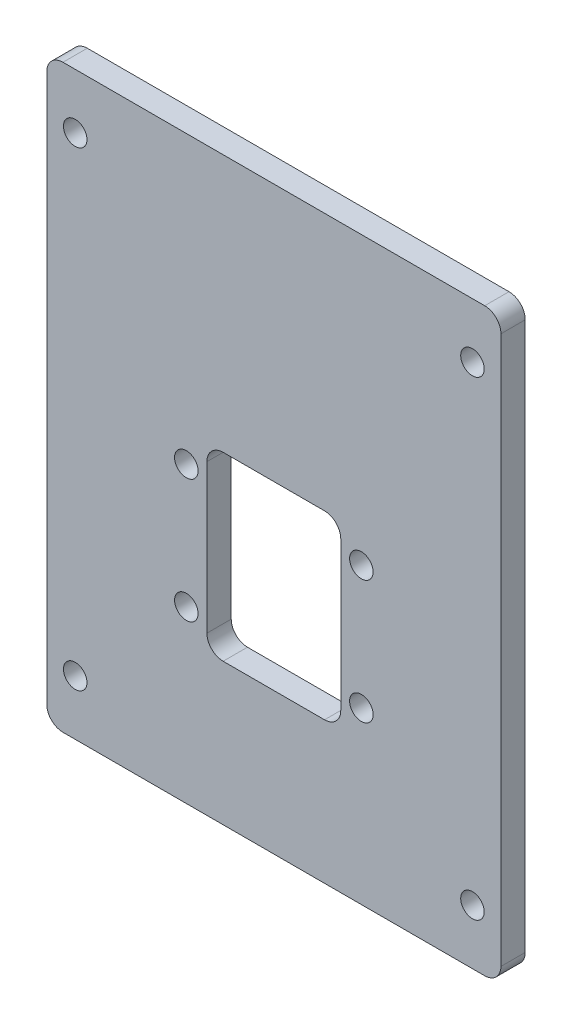
ISO-10303-21;
HEADER;
FILE_DESCRIPTION(('STEP AP214'),'2;1');
FILE_NAME('part.step','',(''),(''),'','','');
FILE_SCHEMA(('AUTOMOTIVE_DESIGN { 1 0 10303 214 1 1 1 1 }'));
ENDSEC;
DATA;
#1=APPLICATION_CONTEXT('core data for automotive mechanical design processes');
#2=APPLICATION_PROTOCOL_DEFINITION('international standard','automotive_design',2000,#1);
#3=PRODUCT_CONTEXT('',#1,'mechanical');
#4=PRODUCT('Part','Part','',(#3));
#5=PRODUCT_RELATED_PRODUCT_CATEGORY('part','',(#4));
#6=PRODUCT_DEFINITION_FORMATION('','',#4);
#7=PRODUCT_DEFINITION_CONTEXT('part definition',#1,'design');
#8=PRODUCT_DEFINITION('design','',#6,#7);
#9=PRODUCT_DEFINITION_SHAPE('','',#8);
#10=(LENGTH_UNIT() NAMED_UNIT(*) SI_UNIT(.MILLI.,.METRE.));
#11=(NAMED_UNIT(*) PLANE_ANGLE_UNIT() SI_UNIT($,.RADIAN.));
#12=(NAMED_UNIT(*) SI_UNIT($,.STERADIAN.) SOLID_ANGLE_UNIT());
#13=UNCERTAINTY_MEASURE_WITH_UNIT(LENGTH_MEASURE(1.E-05),#10,'distance_accuracy_value','');
#14=(GEOMETRIC_REPRESENTATION_CONTEXT(3) GLOBAL_UNCERTAINTY_ASSIGNED_CONTEXT((#13)) GLOBAL_UNIT_ASSIGNED_CONTEXT((#10,
#11,#12)) REPRESENTATION_CONTEXT('',''));
#15=CARTESIAN_POINT('',(0.,0.,0.));
#16=DIRECTION('',(0.,0.,1.));
#17=DIRECTION('',(1.,0.,0.));
#18=AXIS2_PLACEMENT_3D('',#15,#16,#17);
#19=CARTESIAN_POINT('',(0.,0.,3.));
#20=DIRECTION('',(0.,0.,1.));
#21=DIRECTION('',(1.,0.,0.));
#22=AXIS2_PLACEMENT_3D('',#19,#20,#21);
#23=PLANE('',#22);
#24=CARTESIAN_POINT('',(-24.5,-21.84,3.));
#25=DIRECTION('',(0.,0.,1.));
#26=DIRECTION('',(1.,0.,0.));
#27=AXIS2_PLACEMENT_3D('',#24,#25,#26);
#28=CIRCLE('',#27,1.45);
#29=CARTESIAN_POINT('',(-23.05,-21.84,3.));
#30=VERTEX_POINT('',#29);
#31=EDGE_CURVE('E589',#30,#30,#28,.T.);
#32=ORIENTED_EDGE('',*,*,#31,.F.);
#33=EDGE_LOOP('',(#32));
#34=FACE_BOUND('',#33,.T.);
#35=CARTESIAN_POINT('',(24.5,-21.84,3.));
#36=DIRECTION('',(0.,0.,1.));
#37=DIRECTION('',(1.,0.,0.));
#38=AXIS2_PLACEMENT_3D('',#35,#36,#37);
#39=CIRCLE('',#38,1.45);
#40=CARTESIAN_POINT('',(25.95,-21.84,3.));
#41=VERTEX_POINT('',#40);
#42=EDGE_CURVE('E577',#41,#41,#39,.T.);
#43=ORIENTED_EDGE('',*,*,#42,.F.);
#44=EDGE_LOOP('',(#43));
#45=FACE_BOUND('',#44,.T.);
#46=CARTESIAN_POINT('',(10.795,7.62,3.));
#47=DIRECTION('',(0.,0.,1.));
#48=DIRECTION('',(1.,0.,0.));
#49=AXIS2_PLACEMENT_3D('',#46,#47,#48);
#50=CIRCLE('',#49,1.45);
#51=CARTESIAN_POINT('',(12.245,7.62,3.));
#52=VERTEX_POINT('',#51);
#53=EDGE_CURVE('E565',#52,#52,#50,.T.);
#54=ORIENTED_EDGE('',*,*,#53,.F.);
#55=EDGE_LOOP('',(#54));
#56=FACE_BOUND('',#55,.T.);
#57=CARTESIAN_POINT('',(-10.795,-7.62,3.));
#58=DIRECTION('',(0.,0.,1.));
#59=DIRECTION('',(1.,0.,0.));
#60=AXIS2_PLACEMENT_3D('',#57,#58,#59);
#61=CIRCLE('',#60,1.45);
#62=CARTESIAN_POINT('',(-9.34499999999999,-7.62,3.));
#63=VERTEX_POINT('',#62);
#64=EDGE_CURVE('E264',#63,#63,#61,.T.);
#65=ORIENTED_EDGE('',*,*,#64,.F.);
#66=EDGE_LOOP('',(#65));
#67=FACE_BOUND('',#66,.T.);
#68=DIRECTION('',(-1.,0.,0.));
#69=VECTOR('',#68,1.);
#70=CARTESIAN_POINT('',(-28.01,42.95,3.));
#71=LINE('',#70,#69);
#72=CARTESIAN_POINT('',(26.01,42.95,3.));
#73=VERTEX_POINT('',#72);
#74=CARTESIAN_POINT('',(-26.01,42.95,3.));
#75=VERTEX_POINT('',#74);
#76=EDGE_CURVE('E172',#73,#75,#71,.T.);
#77=ORIENTED_EDGE('',*,*,#76,.T.);
#78=CARTESIAN_POINT('',(-26.01,40.95,3.));
#79=DIRECTION('',(0.,0.,1.));
#80=DIRECTION('',(1.,0.,0.));
#81=AXIS2_PLACEMENT_3D('',#78,#79,#80);
#82=CIRCLE('',#81,2.);
#83=CARTESIAN_POINT('',(-28.01,40.95,3.));
#84=VERTEX_POINT('',#83);
#85=EDGE_CURVE('E219',#75,#84,#82,.T.);
#86=ORIENTED_EDGE('',*,*,#85,.T.);
#87=DIRECTION('',(0.,-1.,0.));
#88=VECTOR('',#87,1.);
#89=CARTESIAN_POINT('',(-28.01,42.95,3.));
#90=LINE('',#89,#88);
#91=CARTESIAN_POINT('',(-28.01,-26.63,3.));
#92=VERTEX_POINT('',#91);
#93=EDGE_CURVE('E274',#84,#92,#90,.T.);
#94=ORIENTED_EDGE('',*,*,#93,.T.);
#95=CARTESIAN_POINT('',(-26.01,-26.63,3.));
#96=DIRECTION('',(0.,0.,1.));
#97=DIRECTION('',(1.,0.,0.));
#98=AXIS2_PLACEMENT_3D('',#95,#96,#97);
#99=CIRCLE('',#98,2.);
#100=CARTESIAN_POINT('',(-26.01,-28.63,3.));
#101=VERTEX_POINT('',#100);
#102=EDGE_CURVE('E215',#92,#101,#99,.T.);
#103=ORIENTED_EDGE('',*,*,#102,.T.);
#104=DIRECTION('',(1.,0.,0.));
#105=VECTOR('',#104,1.);
#106=CARTESIAN_POINT('',(-28.01,-28.63,3.));
#107=LINE('',#106,#105);
#108=CARTESIAN_POINT('',(26.01,-28.63,3.));
#109=VERTEX_POINT('',#108);
#110=EDGE_CURVE('E277',#101,#109,#107,.T.);
#111=ORIENTED_EDGE('',*,*,#110,.T.);
#112=CARTESIAN_POINT('',(26.01,-26.63,3.));
#113=DIRECTION('',(0.,0.,1.));
#114=DIRECTION('',(1.,0.,0.));
#115=AXIS2_PLACEMENT_3D('',#112,#113,#114);
#116=CIRCLE('',#115,2.);
#117=CARTESIAN_POINT('',(28.01,-26.63,3.));
#118=VERTEX_POINT('',#117);
#119=EDGE_CURVE('E56',#109,#118,#116,.T.);
#120=ORIENTED_EDGE('',*,*,#119,.T.);
#121=DIRECTION('',(0.,1.,0.));
#122=VECTOR('',#121,1.);
#123=CARTESIAN_POINT('',(28.01,42.95,3.));
#124=LINE('',#123,#122);
#125=CARTESIAN_POINT('',(28.01,40.95,3.));
#126=VERTEX_POINT('',#125);
#127=EDGE_CURVE('E177',#118,#126,#124,.T.);
#128=ORIENTED_EDGE('',*,*,#127,.T.);
#129=CARTESIAN_POINT('',(26.01,40.95,3.));
#130=DIRECTION('',(0.,0.,1.));
#131=DIRECTION('',(1.,0.,0.));
#132=AXIS2_PLACEMENT_3D('',#129,#130,#131);
#133=CIRCLE('',#132,2.);
#134=EDGE_CURVE('E217',#126,#73,#133,.T.);
#135=ORIENTED_EDGE('',*,*,#134,.T.);
#136=EDGE_LOOP('',(#77,#86,#94,#103,#111,#120,#128,#135));
#137=FACE_BOUND('',#136,.T.);
#138=DIRECTION('',(1.,0.,0.));
#139=VECTOR('',#138,1.);
#140=CARTESIAN_POINT('',(-8.25499999999999,-11.16,3.));
#141=LINE('',#140,#139);
#142=CARTESIAN_POINT('',(-6.25499999999999,-11.16,3.));
#143=VERTEX_POINT('',#142);
#144=CARTESIAN_POINT('',(6.25500000000001,-11.16,3.));
#145=VERTEX_POINT('',#144);
#146=EDGE_CURVE('E555',#143,#145,#141,.T.);
#147=ORIENTED_EDGE('',*,*,#146,.F.);
#148=CARTESIAN_POINT('',(-6.25499999999999,-9.16,3.));
#149=DIRECTION('',(0.,0.,1.));
#150=DIRECTION('',(1.,0.,0.));
#151=AXIS2_PLACEMENT_3D('',#148,#149,#150);
#152=CIRCLE('',#151,2.);
#153=CARTESIAN_POINT('',(-8.25499999999999,-9.16,3.));
#154=VERTEX_POINT('',#153);
#155=EDGE_CURVE('E11',#143,#154,#152,.F.);
#156=ORIENTED_EDGE('',*,*,#155,.T.);
#157=DIRECTION('',(0.,-1.,0.));
#158=VECTOR('',#157,1.);
#159=CARTESIAN_POINT('',(-8.25499999999999,11.16,3.));
#160=LINE('',#159,#158);
#161=CARTESIAN_POINT('',(-8.25499999999999,9.16,3.));
#162=VERTEX_POINT('',#161);
#163=EDGE_CURVE('E249',#162,#154,#160,.T.);
#164=ORIENTED_EDGE('',*,*,#163,.F.);
#165=CARTESIAN_POINT('',(-6.25499999999999,9.16,3.));
#166=DIRECTION('',(0.,0.,1.));
#167=DIRECTION('',(1.,0.,0.));
#168=AXIS2_PLACEMENT_3D('',#165,#166,#167);
#169=CIRCLE('',#168,2.);
#170=CARTESIAN_POINT('',(-6.25499999999999,11.16,3.));
#171=VERTEX_POINT('',#170);
#172=EDGE_CURVE('E159',#162,#171,#169,.F.);
#173=ORIENTED_EDGE('',*,*,#172,.T.);
#174=DIRECTION('',(-1.,0.,0.));
#175=VECTOR('',#174,1.);
#176=CARTESIAN_POINT('',(-8.25499999999999,11.16,3.));
#177=LINE('',#176,#175);
#178=CARTESIAN_POINT('',(6.25500000000001,11.16,3.));
#179=VERTEX_POINT('',#178);
#180=EDGE_CURVE('E246',#179,#171,#177,.T.);
#181=ORIENTED_EDGE('',*,*,#180,.F.);
#182=CARTESIAN_POINT('',(6.25500000000001,9.16,3.));
#183=DIRECTION('',(0.,0.,1.));
#184=DIRECTION('',(1.,0.,0.));
#185=AXIS2_PLACEMENT_3D('',#182,#183,#184);
#186=CIRCLE('',#185,2.);
#187=CARTESIAN_POINT('',(8.25500000000001,9.16,3.));
#188=VERTEX_POINT('',#187);
#189=EDGE_CURVE('E236',#179,#188,#186,.F.);
#190=ORIENTED_EDGE('',*,*,#189,.T.);
#191=DIRECTION('',(0.,1.,0.));
#192=VECTOR('',#191,1.);
#193=CARTESIAN_POINT('',(8.25500000000001,11.16,3.));
#194=LINE('',#193,#192);
#195=CARTESIAN_POINT('',(8.25500000000001,-9.16,3.));
#196=VERTEX_POINT('',#195);
#197=EDGE_CURVE('E258',#196,#188,#194,.T.);
#198=ORIENTED_EDGE('',*,*,#197,.F.);
#199=CARTESIAN_POINT('',(6.25500000000001,-9.16,3.));
#200=DIRECTION('',(0.,0.,1.));
#201=DIRECTION('',(1.,0.,0.));
#202=AXIS2_PLACEMENT_3D('',#199,#200,#201);
#203=CIRCLE('',#202,2.);
#204=EDGE_CURVE('E232',#196,#145,#203,.F.);
#205=ORIENTED_EDGE('',*,*,#204,.T.);
#206=EDGE_LOOP('',(#147,#156,#164,#173,#181,#190,#198,#205));
#207=FACE_BOUND('',#206,.T.);
#208=CARTESIAN_POINT('',(-10.795,7.62,3.));
#209=DIRECTION('',(0.,0.,1.));
#210=DIRECTION('',(1.,0.,0.));
#211=AXIS2_PLACEMENT_3D('',#208,#209,#210);
#212=CIRCLE('',#211,1.45);
#213=CARTESIAN_POINT('',(-9.34499999999999,7.62,3.));
#214=VERTEX_POINT('',#213);
#215=EDGE_CURVE('E560',#214,#214,#212,.T.);
#216=ORIENTED_EDGE('',*,*,#215,.F.);
#217=EDGE_LOOP('',(#216));
#218=FACE_BOUND('',#217,.T.);
#219=CARTESIAN_POINT('',(10.795,-7.62,3.));
#220=DIRECTION('',(0.,0.,1.));
#221=DIRECTION('',(1.,0.,0.));
#222=AXIS2_PLACEMENT_3D('',#219,#220,#221);
#223=CIRCLE('',#222,1.45);
#224=CARTESIAN_POINT('',(12.245,-7.62,3.));
#225=VERTEX_POINT('',#224);
#226=EDGE_CURVE('E571',#225,#225,#223,.T.);
#227=ORIENTED_EDGE('',*,*,#226,.F.);
#228=EDGE_LOOP('',(#227));
#229=FACE_BOUND('',#228,.T.);
#230=CARTESIAN_POINT('',(-24.5,36.16,3.));
#231=DIRECTION('',(0.,0.,1.));
#232=DIRECTION('',(1.,0.,0.));
#233=AXIS2_PLACEMENT_3D('',#230,#231,#232);
#234=CIRCLE('',#233,1.45);
#235=CARTESIAN_POINT('',(-23.05,36.16,3.));
#236=VERTEX_POINT('',#235);
#237=EDGE_CURVE('E583',#236,#236,#234,.T.);
#238=ORIENTED_EDGE('',*,*,#237,.F.);
#239=EDGE_LOOP('',(#238));
#240=FACE_BOUND('',#239,.T.);
#241=CARTESIAN_POINT('',(24.5,36.16,3.));
#242=DIRECTION('',(0.,0.,1.));
#243=DIRECTION('',(1.,0.,0.));
#244=AXIS2_PLACEMENT_3D('',#241,#242,#243);
#245=CIRCLE('',#244,1.45);
#246=CARTESIAN_POINT('',(25.95,36.16,3.));
#247=VERTEX_POINT('',#246);
#248=EDGE_CURVE('E595',#247,#247,#245,.T.);
#249=ORIENTED_EDGE('',*,*,#248,.F.);
#250=EDGE_LOOP('',(#249));
#251=FACE_BOUND('',#250,.T.);
#252=ADVANCED_FACE('F34',(#34,#45,#56,#67,#137,#207,#218,#229,#240,#251),#23,.T.);
#253=CARTESIAN_POINT('',(0.,0.,0.));
#254=DIRECTION('',(0.,0.,1.));
#255=DIRECTION('',(1.,0.,0.));
#256=AXIS2_PLACEMENT_3D('',#253,#254,#255);
#257=PLANE('',#256);
#258=DIRECTION('',(0.,-1.,0.));
#259=VECTOR('',#258,1.);
#260=CARTESIAN_POINT('',(-28.01,42.95,0.));
#261=LINE('',#260,#259);
#262=CARTESIAN_POINT('',(-28.01,40.95,0.));
#263=VERTEX_POINT('',#262);
#264=CARTESIAN_POINT('',(-28.01,-26.63,0.));
#265=VERTEX_POINT('',#264);
#266=EDGE_CURVE('E257',#263,#265,#261,.T.);
#267=ORIENTED_EDGE('',*,*,#266,.F.);
#268=CARTESIAN_POINT('',(-26.01,40.95,0.));
#269=DIRECTION('',(0.,0.,1.));
#270=DIRECTION('',(1.,0.,0.));
#271=AXIS2_PLACEMENT_3D('',#268,#269,#270);
#272=CIRCLE('',#271,2.);
#273=CARTESIAN_POINT('',(-26.01,42.95,0.));
#274=VERTEX_POINT('',#273);
#275=EDGE_CURVE('E207',#263,#274,#272,.F.);
#276=ORIENTED_EDGE('',*,*,#275,.T.);
#277=DIRECTION('',(-1.,0.,0.));
#278=VECTOR('',#277,1.);
#279=CARTESIAN_POINT('',(-28.01,42.95,0.));
#280=LINE('',#279,#278);
#281=CARTESIAN_POINT('',(26.01,42.95,0.));
#282=VERTEX_POINT('',#281);
#283=EDGE_CURVE('E180',#282,#274,#280,.T.);
#284=ORIENTED_EDGE('',*,*,#283,.F.);
#285=CARTESIAN_POINT('',(26.01,40.95,0.));
#286=DIRECTION('',(0.,0.,1.));
#287=DIRECTION('',(1.,0.,0.));
#288=AXIS2_PLACEMENT_3D('',#285,#286,#287);
#289=CIRCLE('',#288,2.);
#290=CARTESIAN_POINT('',(28.01,40.95,0.));
#291=VERTEX_POINT('',#290);
#292=EDGE_CURVE('E205',#282,#291,#289,.F.);
#293=ORIENTED_EDGE('',*,*,#292,.T.);
#294=DIRECTION('',(0.,1.,0.));
#295=VECTOR('',#294,1.);
#296=CARTESIAN_POINT('',(28.01,42.95,0.));
#297=LINE('',#296,#295);
#298=CARTESIAN_POINT('',(28.01,-26.63,0.));
#299=VERTEX_POINT('',#298);
#300=EDGE_CURVE('E284',#299,#291,#297,.T.);
#301=ORIENTED_EDGE('',*,*,#300,.F.);
#302=CARTESIAN_POINT('',(26.01,-26.63,0.));
#303=DIRECTION('',(0.,0.,1.));
#304=DIRECTION('',(1.,0.,0.));
#305=AXIS2_PLACEMENT_3D('',#302,#303,#304);
#306=CIRCLE('',#305,2.);
#307=CARTESIAN_POINT('',(26.01,-28.63,0.));
#308=VERTEX_POINT('',#307);
#309=EDGE_CURVE('E201',#299,#308,#306,.F.);
#310=ORIENTED_EDGE('',*,*,#309,.T.);
#311=DIRECTION('',(1.,0.,0.));
#312=VECTOR('',#311,1.);
#313=CARTESIAN_POINT('',(-28.01,-28.63,0.));
#314=LINE('',#313,#312);
#315=CARTESIAN_POINT('',(-26.01,-28.63,0.));
#316=VERTEX_POINT('',#315);
#317=EDGE_CURVE('E282',#316,#308,#314,.T.);
#318=ORIENTED_EDGE('',*,*,#317,.F.);
#319=CARTESIAN_POINT('',(-26.01,-26.63,0.));
#320=DIRECTION('',(0.,0.,1.));
#321=DIRECTION('',(1.,0.,0.));
#322=AXIS2_PLACEMENT_3D('',#319,#320,#321);
#323=CIRCLE('',#322,2.);
#324=EDGE_CURVE('E203',#316,#265,#323,.F.);
#325=ORIENTED_EDGE('',*,*,#324,.T.);
#326=EDGE_LOOP('',(#267,#276,#284,#293,#301,#310,#318,#325));
#327=FACE_BOUND('',#326,.T.);
#328=DIRECTION('',(-1.,0.,0.));
#329=VECTOR('',#328,1.);
#330=CARTESIAN_POINT('',(-8.25499999999999,11.16,0.));
#331=LINE('',#330,#329);
#332=CARTESIAN_POINT('',(6.25500000000001,11.16,0.));
#333=VERTEX_POINT('',#332);
#334=CARTESIAN_POINT('',(-6.25499999999999,11.16,0.));
#335=VERTEX_POINT('',#334);
#336=EDGE_CURVE('E261',#333,#335,#331,.T.);
#337=ORIENTED_EDGE('',*,*,#336,.T.);
#338=CARTESIAN_POINT('',(-6.25499999999999,9.16,0.));
#339=DIRECTION('',(0.,0.,1.));
#340=DIRECTION('',(1.,0.,0.));
#341=AXIS2_PLACEMENT_3D('',#338,#339,#340);
#342=CIRCLE('',#341,2.);
#343=CARTESIAN_POINT('',(-8.25499999999999,9.16,0.));
#344=VERTEX_POINT('',#343);
#345=EDGE_CURVE('E238',#335,#344,#342,.T.);
#346=ORIENTED_EDGE('',*,*,#345,.T.);
#347=DIRECTION('',(0.,-1.,0.));
#348=VECTOR('',#347,1.);
#349=CARTESIAN_POINT('',(-8.25499999999999,11.16,0.));
#350=LINE('',#349,#348);
#351=CARTESIAN_POINT('',(-8.25499999999999,-9.16,0.));
#352=VERTEX_POINT('',#351);
#353=EDGE_CURVE('E154',#344,#352,#350,.T.);
#354=ORIENTED_EDGE('',*,*,#353,.T.);
#355=CARTESIAN_POINT('',(-6.25499999999999,-9.16,0.));
#356=DIRECTION('',(0.,0.,1.));
#357=DIRECTION('',(1.,0.,0.));
#358=AXIS2_PLACEMENT_3D('',#355,#356,#357);
#359=CIRCLE('',#358,2.);
#360=CARTESIAN_POINT('',(-6.25499999999999,-11.16,0.));
#361=VERTEX_POINT('',#360);
#362=EDGE_CURVE('E42',#352,#361,#359,.T.);
#363=ORIENTED_EDGE('',*,*,#362,.T.);
#364=DIRECTION('',(1.,0.,0.));
#365=VECTOR('',#364,1.);
#366=CARTESIAN_POINT('',(-8.25499999999999,-11.16,0.));
#367=LINE('',#366,#365);
#368=CARTESIAN_POINT('',(6.25500000000001,-11.16,0.));
#369=VERTEX_POINT('',#368);
#370=EDGE_CURVE('E152',#361,#369,#367,.T.);
#371=ORIENTED_EDGE('',*,*,#370,.T.);
#372=CARTESIAN_POINT('',(6.25500000000001,-9.16,0.));
#373=DIRECTION('',(0.,0.,1.));
#374=DIRECTION('',(1.,0.,0.));
#375=AXIS2_PLACEMENT_3D('',#372,#373,#374);
#376=CIRCLE('',#375,2.);
#377=CARTESIAN_POINT('',(8.25500000000001,-9.16,0.));
#378=VERTEX_POINT('',#377);
#379=EDGE_CURVE('E230',#369,#378,#376,.T.);
#380=ORIENTED_EDGE('',*,*,#379,.T.);
#381=DIRECTION('',(0.,1.,0.));
#382=VECTOR('',#381,1.);
#383=CARTESIAN_POINT('',(8.25500000000001,11.16,0.));
#384=LINE('',#383,#382);
#385=CARTESIAN_POINT('',(8.25500000000001,9.16,0.));
#386=VERTEX_POINT('',#385);
#387=EDGE_CURVE('E168',#378,#386,#384,.T.);
#388=ORIENTED_EDGE('',*,*,#387,.T.);
#389=CARTESIAN_POINT('',(6.25500000000001,9.16,0.));
#390=DIRECTION('',(0.,0.,1.));
#391=DIRECTION('',(1.,0.,0.));
#392=AXIS2_PLACEMENT_3D('',#389,#390,#391);
#393=CIRCLE('',#392,2.);
#394=EDGE_CURVE('E234',#386,#333,#393,.T.);
#395=ORIENTED_EDGE('',*,*,#394,.T.);
#396=EDGE_LOOP('',(#337,#346,#354,#363,#371,#380,#388,#395));
#397=FACE_BOUND('',#396,.T.);
#398=CARTESIAN_POINT('',(-10.795,-7.62,0.));
#399=DIRECTION('',(0.,0.,1.));
#400=DIRECTION('',(1.,0.,0.));
#401=AXIS2_PLACEMENT_3D('',#398,#399,#400);
#402=CIRCLE('',#401,1.45);
#403=CARTESIAN_POINT('',(-9.34499999999999,-7.62,0.));
#404=VERTEX_POINT('',#403);
#405=EDGE_CURVE('E267',#404,#404,#402,.T.);
#406=ORIENTED_EDGE('',*,*,#405,.T.);
#407=EDGE_LOOP('',(#406));
#408=FACE_BOUND('',#407,.T.);
#409=CARTESIAN_POINT('',(-10.795,7.62,0.));
#410=DIRECTION('',(0.,0.,1.));
#411=DIRECTION('',(1.,0.,0.));
#412=AXIS2_PLACEMENT_3D('',#409,#410,#411);
#413=CIRCLE('',#412,1.45);
#414=CARTESIAN_POINT('',(-9.34499999999999,7.62,0.));
#415=VERTEX_POINT('',#414);
#416=EDGE_CURVE('E562',#415,#415,#413,.T.);
#417=ORIENTED_EDGE('',*,*,#416,.T.);
#418=EDGE_LOOP('',(#417));
#419=FACE_BOUND('',#418,.T.);
#420=CARTESIAN_POINT('',(10.795,7.62,0.));
#421=DIRECTION('',(0.,0.,1.));
#422=DIRECTION('',(1.,0.,0.));
#423=AXIS2_PLACEMENT_3D('',#420,#421,#422);
#424=CIRCLE('',#423,1.45);
#425=CARTESIAN_POINT('',(12.245,7.62,0.));
#426=VERTEX_POINT('',#425);
#427=EDGE_CURVE('E568',#426,#426,#424,.T.);
#428=ORIENTED_EDGE('',*,*,#427,.T.);
#429=EDGE_LOOP('',(#428));
#430=FACE_BOUND('',#429,.T.);
#431=CARTESIAN_POINT('',(10.795,-7.62,0.));
#432=DIRECTION('',(0.,0.,1.));
#433=DIRECTION('',(1.,0.,0.));
#434=AXIS2_PLACEMENT_3D('',#431,#432,#433);
#435=CIRCLE('',#434,1.45);
#436=CARTESIAN_POINT('',(12.245,-7.62,0.));
#437=VERTEX_POINT('',#436);
#438=EDGE_CURVE('E574',#437,#437,#435,.T.);
#439=ORIENTED_EDGE('',*,*,#438,.T.);
#440=EDGE_LOOP('',(#439));
#441=FACE_BOUND('',#440,.T.);
#442=CARTESIAN_POINT('',(24.5,-21.84,0.));
#443=DIRECTION('',(0.,0.,1.));
#444=DIRECTION('',(1.,0.,0.));
#445=AXIS2_PLACEMENT_3D('',#442,#443,#444);
#446=CIRCLE('',#445,1.45);
#447=CARTESIAN_POINT('',(25.95,-21.84,0.));
#448=VERTEX_POINT('',#447);
#449=EDGE_CURVE('E580',#448,#448,#446,.T.);
#450=ORIENTED_EDGE('',*,*,#449,.T.);
#451=EDGE_LOOP('',(#450));
#452=FACE_BOUND('',#451,.T.);
#453=CARTESIAN_POINT('',(-24.5,36.16,0.));
#454=DIRECTION('',(0.,0.,1.));
#455=DIRECTION('',(1.,0.,0.));
#456=AXIS2_PLACEMENT_3D('',#453,#454,#455);
#457=CIRCLE('',#456,1.45);
#458=CARTESIAN_POINT('',(-23.05,36.16,0.));
#459=VERTEX_POINT('',#458);
#460=EDGE_CURVE('E586',#459,#459,#457,.T.);
#461=ORIENTED_EDGE('',*,*,#460,.T.);
#462=EDGE_LOOP('',(#461));
#463=FACE_BOUND('',#462,.T.);
#464=CARTESIAN_POINT('',(-24.5,-21.84,0.));
#465=DIRECTION('',(0.,0.,1.));
#466=DIRECTION('',(1.,0.,0.));
#467=AXIS2_PLACEMENT_3D('',#464,#465,#466);
#468=CIRCLE('',#467,1.45);
#469=CARTESIAN_POINT('',(-23.05,-21.84,0.));
#470=VERTEX_POINT('',#469);
#471=EDGE_CURVE('E592',#470,#470,#468,.T.);
#472=ORIENTED_EDGE('',*,*,#471,.T.);
#473=EDGE_LOOP('',(#472));
#474=FACE_BOUND('',#473,.T.);
#475=CARTESIAN_POINT('',(24.5,36.16,0.));
#476=DIRECTION('',(0.,0.,1.));
#477=DIRECTION('',(1.,0.,0.));
#478=AXIS2_PLACEMENT_3D('',#475,#476,#477);
#479=CIRCLE('',#478,1.45);
#480=CARTESIAN_POINT('',(25.95,36.16,0.));
#481=VERTEX_POINT('',#480);
#482=EDGE_CURVE('E598',#481,#481,#479,.T.);
#483=ORIENTED_EDGE('',*,*,#482,.T.);
#484=EDGE_LOOP('',(#483));
#485=FACE_BOUND('',#484,.T.);
#486=ADVANCED_FACE('F150',(#327,#397,#408,#419,#430,#441,#452,#463,#474,#485),#257,.F.);
#487=CARTESIAN_POINT('',(-28.01,42.95,3.));
#488=DIRECTION('',(1.,0.,0.));
#489=DIRECTION('',(0.,1.,0.));
#490=AXIS2_PLACEMENT_3D('',#487,#488,#489);
#491=PLANE('',#490);
#492=ORIENTED_EDGE('',*,*,#93,.F.);
#493=DIRECTION('',(0.,0.,-1.));
#494=VECTOR('',#493,1.);
#495=CARTESIAN_POINT('',(-28.01,40.95,3.));
#496=LINE('',#495,#494);
#497=EDGE_CURVE('E198',#84,#263,#496,.T.);
#498=ORIENTED_EDGE('',*,*,#497,.T.);
#499=ORIENTED_EDGE('',*,*,#266,.T.);
#500=DIRECTION('',(0.,0.,-1.));
#501=VECTOR('',#500,1.);
#502=CARTESIAN_POINT('',(-28.01,-26.63,3.));
#503=LINE('',#502,#501);
#504=EDGE_CURVE('E196',#265,#92,#503,.F.);
#505=ORIENTED_EDGE('',*,*,#504,.T.);
#506=EDGE_LOOP('',(#492,#498,#499,#505));
#507=FACE_BOUND('',#506,.T.);
#508=ADVANCED_FACE('F301',(#507),#491,.F.);
#509=CARTESIAN_POINT('',(-28.01,-28.63,3.));
#510=DIRECTION('',(0.,1.,0.));
#511=DIRECTION('',(0.,0.,1.));
#512=AXIS2_PLACEMENT_3D('',#509,#510,#511);
#513=PLANE('',#512);
#514=ORIENTED_EDGE('',*,*,#110,.F.);
#515=DIRECTION('',(0.,0.,-1.));
#516=VECTOR('',#515,1.);
#517=CARTESIAN_POINT('',(-26.01,-28.63,3.));
#518=LINE('',#517,#516);
#519=EDGE_CURVE('E227',#101,#316,#518,.T.);
#520=ORIENTED_EDGE('',*,*,#519,.T.);
#521=ORIENTED_EDGE('',*,*,#317,.T.);
#522=DIRECTION('',(0.,0.,-1.));
#523=VECTOR('',#522,1.);
#524=CARTESIAN_POINT('',(26.01,-28.63,3.));
#525=LINE('',#524,#523);
#526=EDGE_CURVE('E225',#308,#109,#525,.F.);
#527=ORIENTED_EDGE('',*,*,#526,.T.);
#528=EDGE_LOOP('',(#514,#520,#521,#527));
#529=FACE_BOUND('',#528,.T.);
#530=ADVANCED_FACE('F309',(#529),#513,.F.);
#531=CARTESIAN_POINT('',(28.01,42.95,3.));
#532=DIRECTION('',(-1.,0.,0.));
#533=DIRECTION('',(0.,-1.,0.));
#534=AXIS2_PLACEMENT_3D('',#531,#532,#533);
#535=PLANE('',#534);
#536=ORIENTED_EDGE('',*,*,#300,.T.);
#537=DIRECTION('',(0.,0.,-1.));
#538=VECTOR('',#537,1.);
#539=CARTESIAN_POINT('',(28.01,40.95,3.));
#540=LINE('',#539,#538);
#541=EDGE_CURVE('E49',#291,#126,#540,.F.);
#542=ORIENTED_EDGE('',*,*,#541,.T.);
#543=ORIENTED_EDGE('',*,*,#127,.F.);
#544=DIRECTION('',(0.,0.,-1.));
#545=VECTOR('',#544,1.);
#546=CARTESIAN_POINT('',(28.01,-26.63,3.));
#547=LINE('',#546,#545);
#548=EDGE_CURVE('E221',#118,#299,#547,.T.);
#549=ORIENTED_EDGE('',*,*,#548,.T.);
#550=EDGE_LOOP('',(#536,#542,#543,#549));
#551=FACE_BOUND('',#550,.T.);
#552=ADVANCED_FACE('F314',(#551),#535,.F.);
#553=CARTESIAN_POINT('',(-28.01,42.95,3.));
#554=DIRECTION('',(0.,-1.,0.));
#555=DIRECTION('',(0.,0.,-1.));
#556=AXIS2_PLACEMENT_3D('',#553,#554,#555);
#557=PLANE('',#556);
#558=ORIENTED_EDGE('',*,*,#283,.T.);
#559=DIRECTION('',(0.,0.,-1.));
#560=VECTOR('',#559,1.);
#561=CARTESIAN_POINT('',(-26.01,42.95,3.));
#562=LINE('',#561,#560);
#563=EDGE_CURVE('E212',#274,#75,#562,.F.);
#564=ORIENTED_EDGE('',*,*,#563,.T.);
#565=ORIENTED_EDGE('',*,*,#76,.F.);
#566=DIRECTION('',(0.,0.,-1.));
#567=VECTOR('',#566,1.);
#568=CARTESIAN_POINT('',(26.01,42.95,3.));
#569=LINE('',#568,#567);
#570=EDGE_CURVE('E209',#73,#282,#569,.T.);
#571=ORIENTED_EDGE('',*,*,#570,.T.);
#572=EDGE_LOOP('',(#558,#564,#565,#571));
#573=FACE_BOUND('',#572,.T.);
#574=ADVANCED_FACE('F290',(#573),#557,.F.);
#575=CARTESIAN_POINT('',(-8.25499999999999,11.16,3.));
#576=DIRECTION('',(1.,0.,0.));
#577=DIRECTION('',(0.,0.,-1.));
#578=AXIS2_PLACEMENT_3D('',#575,#576,#577);
#579=PLANE('',#578);
#580=ORIENTED_EDGE('',*,*,#353,.F.);
#581=DIRECTION('',(0.,0.,-1.));
#582=VECTOR('',#581,1.);
#583=CARTESIAN_POINT('',(-8.25499999999999,9.16,3.));
#584=LINE('',#583,#582);
#585=EDGE_CURVE('E194',#344,#162,#584,.F.);
#586=ORIENTED_EDGE('',*,*,#585,.T.);
#587=ORIENTED_EDGE('',*,*,#163,.T.);
#588=DIRECTION('',(0.,0.,-1.));
#589=VECTOR('',#588,1.);
#590=CARTESIAN_POINT('',(-8.25499999999999,-9.16,0.));
#591=LINE('',#590,#589);
#592=EDGE_CURVE('E192',#154,#352,#591,.T.);
#593=ORIENTED_EDGE('',*,*,#592,.T.);
#594=EDGE_LOOP('',(#580,#586,#587,#593));
#595=FACE_BOUND('',#594,.T.);
#596=ADVANCED_FACE('F263',(#595),#579,.T.);
#597=CARTESIAN_POINT('',(-8.25499999999999,-11.16,3.));
#598=DIRECTION('',(0.,1.,0.));
#599=DIRECTION('',(0.,0.,1.));
#600=AXIS2_PLACEMENT_3D('',#597,#598,#599);
#601=PLANE('',#600);
#602=ORIENTED_EDGE('',*,*,#146,.T.);
#603=DIRECTION('',(0.,0.,-1.));
#604=VECTOR('',#603,1.);
#605=CARTESIAN_POINT('',(6.25500000000001,-11.16,0.));
#606=LINE('',#605,#604);
#607=EDGE_CURVE('E167',#145,#369,#606,.T.);
#608=ORIENTED_EDGE('',*,*,#607,.T.);
#609=ORIENTED_EDGE('',*,*,#370,.F.);
#610=DIRECTION('',(0.,0.,-1.));
#611=VECTOR('',#610,1.);
#612=CARTESIAN_POINT('',(-6.25499999999999,-11.16,3.));
#613=LINE('',#612,#611);
#614=EDGE_CURVE('E164',#361,#143,#613,.F.);
#615=ORIENTED_EDGE('',*,*,#614,.T.);
#616=EDGE_LOOP('',(#602,#608,#609,#615));
#617=FACE_BOUND('',#616,.T.);
#618=ADVANCED_FACE('F163',(#617),#601,.T.);
#619=CARTESIAN_POINT('',(8.25500000000001,11.16,3.));
#620=DIRECTION('',(-1.,0.,0.));
#621=DIRECTION('',(0.,0.,1.));
#622=AXIS2_PLACEMENT_3D('',#619,#620,#621);
#623=PLANE('',#622);
#624=ORIENTED_EDGE('',*,*,#387,.F.);
#625=DIRECTION('',(0.,0.,-1.));
#626=VECTOR('',#625,1.);
#627=CARTESIAN_POINT('',(8.25500000000001,-9.16,3.));
#628=LINE('',#627,#626);
#629=EDGE_CURVE('E185',#378,#196,#628,.F.);
#630=ORIENTED_EDGE('',*,*,#629,.T.);
#631=ORIENTED_EDGE('',*,*,#197,.T.);
#632=DIRECTION('',(0.,0.,-1.));
#633=VECTOR('',#632,1.);
#634=CARTESIAN_POINT('',(8.25500000000001,9.16,0.));
#635=LINE('',#634,#633);
#636=EDGE_CURVE('E174',#188,#386,#635,.T.);
#637=ORIENTED_EDGE('',*,*,#636,.T.);
#638=EDGE_LOOP('',(#624,#630,#631,#637));
#639=FACE_BOUND('',#638,.T.);
#640=ADVANCED_FACE('F479',(#639),#623,.T.);
#641=CARTESIAN_POINT('',(-8.25499999999999,11.16,3.));
#642=DIRECTION('',(0.,-1.,0.));
#643=DIRECTION('',(0.,0.,-1.));
#644=AXIS2_PLACEMENT_3D('',#641,#642,#643);
#645=PLANE('',#644);
#646=ORIENTED_EDGE('',*,*,#336,.F.);
#647=DIRECTION('',(0.,0.,-1.));
#648=VECTOR('',#647,1.);
#649=CARTESIAN_POINT('',(6.25500000000001,11.16,3.));
#650=LINE('',#649,#648);
#651=EDGE_CURVE('E190',#333,#179,#650,.F.);
#652=ORIENTED_EDGE('',*,*,#651,.T.);
#653=ORIENTED_EDGE('',*,*,#180,.T.);
#654=DIRECTION('',(0.,0.,-1.));
#655=VECTOR('',#654,1.);
#656=CARTESIAN_POINT('',(-6.25499999999999,11.16,0.));
#657=LINE('',#656,#655);
#658=EDGE_CURVE('E187',#171,#335,#657,.T.);
#659=ORIENTED_EDGE('',*,*,#658,.T.);
#660=EDGE_LOOP('',(#646,#652,#653,#659));
#661=FACE_BOUND('',#660,.T.);
#662=ADVANCED_FACE('F255',(#661),#645,.T.);
#663=CARTESIAN_POINT('',(-10.795,-7.62,3.));
#664=DIRECTION('',(0.,0.,-1.));
#665=DIRECTION('',(-1.,0.,0.));
#666=AXIS2_PLACEMENT_3D('',#663,#664,#665);
#667=CYLINDRICAL_SURFACE('',#666,1.45);
#668=ORIENTED_EDGE('',*,*,#64,.T.);
#669=EDGE_LOOP('',(#668));
#670=FACE_BOUND('',#669,.T.);
#671=ORIENTED_EDGE('',*,*,#405,.F.);
#672=EDGE_LOOP('',(#671));
#673=FACE_BOUND('',#672,.T.);
#674=ADVANCED_FACE('F463',(#670,#673),#667,.F.);
#675=CARTESIAN_POINT('',(-10.795,7.62,3.));
#676=DIRECTION('',(0.,0.,-1.));
#677=DIRECTION('',(-1.,0.,0.));
#678=AXIS2_PLACEMENT_3D('',#675,#676,#677);
#679=CYLINDRICAL_SURFACE('',#678,1.45);
#680=ORIENTED_EDGE('',*,*,#215,.T.);
#681=EDGE_LOOP('',(#680));
#682=FACE_BOUND('',#681,.T.);
#683=ORIENTED_EDGE('',*,*,#416,.F.);
#684=EDGE_LOOP('',(#683));
#685=FACE_BOUND('',#684,.T.);
#686=ADVANCED_FACE('F454',(#682,#685),#679,.F.);
#687=CARTESIAN_POINT('',(10.795,7.62,3.));
#688=DIRECTION('',(0.,0.,-1.));
#689=DIRECTION('',(-1.,0.,0.));
#690=AXIS2_PLACEMENT_3D('',#687,#688,#689);
#691=CYLINDRICAL_SURFACE('',#690,1.45);
#692=ORIENTED_EDGE('',*,*,#53,.T.);
#693=EDGE_LOOP('',(#692));
#694=FACE_BOUND('',#693,.T.);
#695=ORIENTED_EDGE('',*,*,#427,.F.);
#696=EDGE_LOOP('',(#695));
#697=FACE_BOUND('',#696,.T.);
#698=ADVANCED_FACE('F445',(#694,#697),#691,.F.);
#699=CARTESIAN_POINT('',(10.795,-7.62,3.));
#700=DIRECTION('',(0.,0.,-1.));
#701=DIRECTION('',(-1.,0.,0.));
#702=AXIS2_PLACEMENT_3D('',#699,#700,#701);
#703=CYLINDRICAL_SURFACE('',#702,1.45);
#704=ORIENTED_EDGE('',*,*,#226,.T.);
#705=EDGE_LOOP('',(#704));
#706=FACE_BOUND('',#705,.T.);
#707=ORIENTED_EDGE('',*,*,#438,.F.);
#708=EDGE_LOOP('',(#707));
#709=FACE_BOUND('',#708,.T.);
#710=ADVANCED_FACE('F436',(#706,#709),#703,.F.);
#711=CARTESIAN_POINT('',(24.5,-21.84,3.));
#712=DIRECTION('',(0.,0.,-1.));
#713=DIRECTION('',(-1.,0.,0.));
#714=AXIS2_PLACEMENT_3D('',#711,#712,#713);
#715=CYLINDRICAL_SURFACE('',#714,1.45);
#716=ORIENTED_EDGE('',*,*,#42,.T.);
#717=EDGE_LOOP('',(#716));
#718=FACE_BOUND('',#717,.T.);
#719=ORIENTED_EDGE('',*,*,#449,.F.);
#720=EDGE_LOOP('',(#719));
#721=FACE_BOUND('',#720,.T.);
#722=ADVANCED_FACE('F427',(#718,#721),#715,.F.);
#723=CARTESIAN_POINT('',(-24.5,36.16,3.));
#724=DIRECTION('',(0.,0.,-1.));
#725=DIRECTION('',(-1.,0.,0.));
#726=AXIS2_PLACEMENT_3D('',#723,#724,#725);
#727=CYLINDRICAL_SURFACE('',#726,1.45);
#728=ORIENTED_EDGE('',*,*,#237,.T.);
#729=EDGE_LOOP('',(#728));
#730=FACE_BOUND('',#729,.T.);
#731=ORIENTED_EDGE('',*,*,#460,.F.);
#732=EDGE_LOOP('',(#731));
#733=FACE_BOUND('',#732,.T.);
#734=ADVANCED_FACE('F418',(#730,#733),#727,.F.);
#735=CARTESIAN_POINT('',(-24.5,-21.84,3.));
#736=DIRECTION('',(0.,0.,-1.));
#737=DIRECTION('',(-1.,0.,0.));
#738=AXIS2_PLACEMENT_3D('',#735,#736,#737);
#739=CYLINDRICAL_SURFACE('',#738,1.45);
#740=ORIENTED_EDGE('',*,*,#31,.T.);
#741=EDGE_LOOP('',(#740));
#742=FACE_BOUND('',#741,.T.);
#743=ORIENTED_EDGE('',*,*,#471,.F.);
#744=EDGE_LOOP('',(#743));
#745=FACE_BOUND('',#744,.T.);
#746=ADVANCED_FACE('F409',(#742,#745),#739,.F.);
#747=CARTESIAN_POINT('',(24.5,36.16,3.));
#748=DIRECTION('',(0.,0.,-1.));
#749=DIRECTION('',(-1.,0.,0.));
#750=AXIS2_PLACEMENT_3D('',#747,#748,#749);
#751=CYLINDRICAL_SURFACE('',#750,1.45);
#752=ORIENTED_EDGE('',*,*,#248,.T.);
#753=EDGE_LOOP('',(#752));
#754=FACE_BOUND('',#753,.T.);
#755=ORIENTED_EDGE('',*,*,#482,.F.);
#756=EDGE_LOOP('',(#755));
#757=FACE_BOUND('',#756,.T.);
#758=ADVANCED_FACE('F349',(#754,#757),#751,.F.);
#759=CARTESIAN_POINT('',(6.25500000000001,-9.16,3.));
#760=DIRECTION('',(0.,0.,1.));
#761=DIRECTION('',(1.,0.,0.));
#762=AXIS2_PLACEMENT_3D('',#759,#760,#761);
#763=CYLINDRICAL_SURFACE('',#762,2.);
#764=ORIENTED_EDGE('',*,*,#204,.F.);
#765=ORIENTED_EDGE('',*,*,#629,.F.);
#766=ORIENTED_EDGE('',*,*,#379,.F.);
#767=ORIENTED_EDGE('',*,*,#607,.F.);
#768=EDGE_LOOP('',(#764,#765,#766,#767));
#769=FACE_BOUND('',#768,.T.);
#770=ADVANCED_FACE('F345',(#769),#763,.F.);
#771=CARTESIAN_POINT('',(6.25500000000001,9.16,3.));
#772=DIRECTION('',(0.,0.,1.));
#773=DIRECTION('',(1.,0.,0.));
#774=AXIS2_PLACEMENT_3D('',#771,#772,#773);
#775=CYLINDRICAL_SURFACE('',#774,2.);
#776=ORIENTED_EDGE('',*,*,#189,.F.);
#777=ORIENTED_EDGE('',*,*,#651,.F.);
#778=ORIENTED_EDGE('',*,*,#394,.F.);
#779=ORIENTED_EDGE('',*,*,#636,.F.);
#780=EDGE_LOOP('',(#776,#777,#778,#779));
#781=FACE_BOUND('',#780,.T.);
#782=ADVANCED_FACE('F348',(#781),#775,.F.);
#783=CARTESIAN_POINT('',(-6.25499999999999,9.16,3.));
#784=DIRECTION('',(0.,0.,1.));
#785=DIRECTION('',(1.,0.,0.));
#786=AXIS2_PLACEMENT_3D('',#783,#784,#785);
#787=CYLINDRICAL_SURFACE('',#786,2.);
#788=ORIENTED_EDGE('',*,*,#172,.F.);
#789=ORIENTED_EDGE('',*,*,#585,.F.);
#790=ORIENTED_EDGE('',*,*,#345,.F.);
#791=ORIENTED_EDGE('',*,*,#658,.F.);
#792=EDGE_LOOP('',(#788,#789,#790,#791));
#793=FACE_BOUND('',#792,.T.);
#794=ADVANCED_FACE('F260',(#793),#787,.F.);
#795=CARTESIAN_POINT('',(-6.25499999999999,-9.16,3.));
#796=DIRECTION('',(0.,0.,1.));
#797=DIRECTION('',(1.,0.,0.));
#798=AXIS2_PLACEMENT_3D('',#795,#796,#797);
#799=CYLINDRICAL_SURFACE('',#798,2.);
#800=ORIENTED_EDGE('',*,*,#155,.F.);
#801=ORIENTED_EDGE('',*,*,#614,.F.);
#802=ORIENTED_EDGE('',*,*,#362,.F.);
#803=ORIENTED_EDGE('',*,*,#592,.F.);
#804=EDGE_LOOP('',(#800,#801,#802,#803));
#805=FACE_BOUND('',#804,.T.);
#806=ADVANCED_FACE('F171',(#805),#799,.F.);
#807=CARTESIAN_POINT('',(-26.01,40.95,3.));
#808=DIRECTION('',(0.,0.,-1.));
#809=DIRECTION('',(-1.,0.,0.));
#810=AXIS2_PLACEMENT_3D('',#807,#808,#809);
#811=CYLINDRICAL_SURFACE('',#810,2.);
#812=ORIENTED_EDGE('',*,*,#85,.F.);
#813=ORIENTED_EDGE('',*,*,#563,.F.);
#814=ORIENTED_EDGE('',*,*,#275,.F.);
#815=ORIENTED_EDGE('',*,*,#497,.F.);
#816=EDGE_LOOP('',(#812,#813,#814,#815));
#817=FACE_BOUND('',#816,.T.);
#818=ADVANCED_FACE('F296',(#817),#811,.T.);
#819=CARTESIAN_POINT('',(26.01,40.95,3.));
#820=DIRECTION('',(0.,0.,-1.));
#821=DIRECTION('',(-1.,0.,0.));
#822=AXIS2_PLACEMENT_3D('',#819,#820,#821);
#823=CYLINDRICAL_SURFACE('',#822,2.);
#824=ORIENTED_EDGE('',*,*,#134,.F.);
#825=ORIENTED_EDGE('',*,*,#541,.F.);
#826=ORIENTED_EDGE('',*,*,#292,.F.);
#827=ORIENTED_EDGE('',*,*,#570,.F.);
#828=EDGE_LOOP('',(#824,#825,#826,#827));
#829=FACE_BOUND('',#828,.T.);
#830=ADVANCED_FACE('F317',(#829),#823,.T.);
#831=CARTESIAN_POINT('',(-26.01,-26.63,3.));
#832=DIRECTION('',(0.,0.,-1.));
#833=DIRECTION('',(-1.,0.,0.));
#834=AXIS2_PLACEMENT_3D('',#831,#832,#833);
#835=CYLINDRICAL_SURFACE('',#834,2.);
#836=ORIENTED_EDGE('',*,*,#102,.F.);
#837=ORIENTED_EDGE('',*,*,#504,.F.);
#838=ORIENTED_EDGE('',*,*,#324,.F.);
#839=ORIENTED_EDGE('',*,*,#519,.F.);
#840=EDGE_LOOP('',(#836,#837,#838,#839));
#841=FACE_BOUND('',#840,.T.);
#842=ADVANCED_FACE('F305',(#841),#835,.T.);
#843=CARTESIAN_POINT('',(26.01,-26.63,3.));
#844=DIRECTION('',(0.,0.,-1.));
#845=DIRECTION('',(-1.,0.,0.));
#846=AXIS2_PLACEMENT_3D('',#843,#844,#845);
#847=CYLINDRICAL_SURFACE('',#846,2.);
#848=ORIENTED_EDGE('',*,*,#119,.F.);
#849=ORIENTED_EDGE('',*,*,#526,.F.);
#850=ORIENTED_EDGE('',*,*,#309,.F.);
#851=ORIENTED_EDGE('',*,*,#548,.F.);
#852=EDGE_LOOP('',(#848,#849,#850,#851));
#853=FACE_BOUND('',#852,.T.);
#854=ADVANCED_FACE('F36',(#853),#847,.T.);
#855=CLOSED_SHELL('',(#252,#486,#508,#530,#552,#574,#596,#618,#640,#662,#674,#686,#698,#710,
#722,#734,#746,#758,#770,#782,#794,#806,#818,#830,#842,#854));
#856=MANIFOLD_SOLID_BREP('B2',#855);
#857=ADVANCED_BREP_SHAPE_REPRESENTATION('',(#18,#856),#14);
#858=SHAPE_DEFINITION_REPRESENTATION(#9,#857);
ENDSEC;
END-ISO-10303-21;
